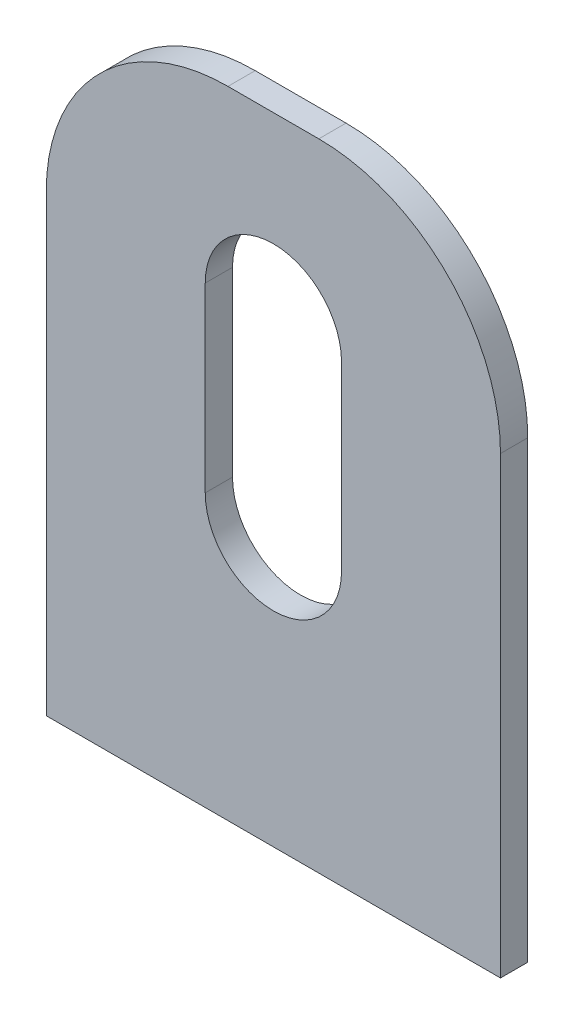
ISO-10303-21;
HEADER;
FILE_DESCRIPTION(('STEP AP214'),'2;1');
FILE_NAME('part.step','',(''),(''),'','','');
FILE_SCHEMA(('AUTOMOTIVE_DESIGN { 1 0 10303 214 1 1 1 1 }'));
ENDSEC;
DATA;
#1=APPLICATION_CONTEXT('core data for automotive mechanical design processes');
#2=APPLICATION_PROTOCOL_DEFINITION('international standard','automotive_design',2000,#1);
#3=PRODUCT_CONTEXT('',#1,'mechanical');
#4=PRODUCT('Part','Part','',(#3));
#5=PRODUCT_RELATED_PRODUCT_CATEGORY('part','',(#4));
#6=PRODUCT_DEFINITION_FORMATION('','',#4);
#7=PRODUCT_DEFINITION_CONTEXT('part definition',#1,'design');
#8=PRODUCT_DEFINITION('design','',#6,#7);
#9=PRODUCT_DEFINITION_SHAPE('','',#8);
#10=(LENGTH_UNIT() NAMED_UNIT(*) SI_UNIT(.MILLI.,.METRE.));
#11=(NAMED_UNIT(*) PLANE_ANGLE_UNIT() SI_UNIT($,.RADIAN.));
#12=(NAMED_UNIT(*) SI_UNIT($,.STERADIAN.) SOLID_ANGLE_UNIT());
#13=UNCERTAINTY_MEASURE_WITH_UNIT(LENGTH_MEASURE(1.E-05),#10,'distance_accuracy_value','');
#14=(GEOMETRIC_REPRESENTATION_CONTEXT(3) GLOBAL_UNCERTAINTY_ASSIGNED_CONTEXT((#13)) GLOBAL_UNIT_ASSIGNED_CONTEXT((#10,
#11,#12)) REPRESENTATION_CONTEXT('',''));
#15=CARTESIAN_POINT('',(0.,0.,0.));
#16=DIRECTION('',(0.,0.,1.));
#17=DIRECTION('',(1.,0.,0.));
#18=AXIS2_PLACEMENT_3D('',#15,#16,#17);
#19=CARTESIAN_POINT('',(-25.,40.,3.));
#20=DIRECTION('',(1.,0.,0.));
#21=DIRECTION('',(0.,1.,0.));
#22=AXIS2_PLACEMENT_3D('',#19,#20,#21);
#23=PLANE('',#22);
#24=DIRECTION('',(0.,-1.,0.));
#25=VECTOR('',#24,1.);
#26=CARTESIAN_POINT('',(-25.,40.,3.));
#27=LINE('',#26,#25);
#28=CARTESIAN_POINT('',(-25.,20.,3.));
#29=VERTEX_POINT('',#28);
#30=CARTESIAN_POINT('',(-25.,-30.,3.));
#31=VERTEX_POINT('',#30);
#32=EDGE_CURVE('E152',#29,#31,#27,.T.);
#33=ORIENTED_EDGE('',*,*,#32,.F.);
#34=DIRECTION('',(0.,0.,-1.));
#35=VECTOR('',#34,1.);
#36=CARTESIAN_POINT('',(-25.,20.,3.));
#37=LINE('',#36,#35);
#38=CARTESIAN_POINT('',(-25.,20.,0.));
#39=VERTEX_POINT('',#38);
#40=EDGE_CURVE('E11',#29,#39,#37,.T.);
#41=ORIENTED_EDGE('',*,*,#40,.T.);
#42=DIRECTION('',(0.,-1.,0.));
#43=VECTOR('',#42,1.);
#44=CARTESIAN_POINT('',(-25.,40.,0.));
#45=LINE('',#44,#43);
#46=CARTESIAN_POINT('',(-25.,-30.,0.));
#47=VERTEX_POINT('',#46);
#48=EDGE_CURVE('E162',#39,#47,#45,.T.);
#49=ORIENTED_EDGE('',*,*,#48,.T.);
#50=DIRECTION('',(0.,0.,-1.));
#51=VECTOR('',#50,1.);
#52=CARTESIAN_POINT('',(-25.,-30.,3.));
#53=LINE('',#52,#51);
#54=EDGE_CURVE('E172',#31,#47,#53,.T.);
#55=ORIENTED_EDGE('',*,*,#54,.F.);
#56=EDGE_LOOP('',(#33,#41,#49,#55));
#57=FACE_BOUND('',#56,.T.);
#58=ADVANCED_FACE('F35',(#57),#23,.F.);
#59=CARTESIAN_POINT('',(-25.,-30.,3.));
#60=DIRECTION('',(0.,1.,0.));
#61=DIRECTION('',(0.,0.,1.));
#62=AXIS2_PLACEMENT_3D('',#59,#60,#61);
#63=PLANE('',#62);
#64=DIRECTION('',(1.,0.,0.));
#65=VECTOR('',#64,1.);
#66=CARTESIAN_POINT('',(-25.,-30.,0.));
#67=LINE('',#66,#65);
#68=CARTESIAN_POINT('',(25.,-30.,0.));
#69=VERTEX_POINT('',#68);
#70=EDGE_CURVE('E164',#47,#69,#67,.T.);
#71=ORIENTED_EDGE('',*,*,#70,.T.);
#72=DIRECTION('',(0.,0.,-1.));
#73=VECTOR('',#72,1.);
#74=CARTESIAN_POINT('',(25.,-30.,3.));
#75=LINE('',#74,#73);
#76=CARTESIAN_POINT('',(25.,-30.,3.));
#77=VERTEX_POINT('',#76);
#78=EDGE_CURVE('E161',#77,#69,#75,.T.);
#79=ORIENTED_EDGE('',*,*,#78,.F.);
#80=DIRECTION('',(1.,0.,0.));
#81=VECTOR('',#80,1.);
#82=CARTESIAN_POINT('',(-25.,-30.,3.));
#83=LINE('',#82,#81);
#84=EDGE_CURVE('E154',#31,#77,#83,.T.);
#85=ORIENTED_EDGE('',*,*,#84,.F.);
#86=ORIENTED_EDGE('',*,*,#54,.T.);
#87=EDGE_LOOP('',(#71,#79,#85,#86));
#88=FACE_BOUND('',#87,.T.);
#89=ADVANCED_FACE('F207',(#88),#63,.F.);
#90=CARTESIAN_POINT('',(25.,40.,3.));
#91=DIRECTION('',(-1.,0.,0.));
#92=DIRECTION('',(0.,-1.,0.));
#93=AXIS2_PLACEMENT_3D('',#90,#91,#92);
#94=PLANE('',#93);
#95=DIRECTION('',(0.,1.,0.));
#96=VECTOR('',#95,1.);
#97=CARTESIAN_POINT('',(25.,40.,0.));
#98=LINE('',#97,#96);
#99=CARTESIAN_POINT('',(25.,20.,0.));
#100=VERTEX_POINT('',#99);
#101=EDGE_CURVE('E166',#69,#100,#98,.T.);
#102=ORIENTED_EDGE('',*,*,#101,.T.);
#103=DIRECTION('',(0.,0.,-1.));
#104=VECTOR('',#103,1.);
#105=CARTESIAN_POINT('',(25.,20.,3.));
#106=LINE('',#105,#104);
#107=CARTESIAN_POINT('',(25.,20.,3.));
#108=VERTEX_POINT('',#107);
#109=EDGE_CURVE('E58',#100,#108,#106,.F.);
#110=ORIENTED_EDGE('',*,*,#109,.T.);
#111=DIRECTION('',(0.,1.,0.));
#112=VECTOR('',#111,1.);
#113=CARTESIAN_POINT('',(25.,40.,3.));
#114=LINE('',#113,#112);
#115=EDGE_CURVE('E157',#77,#108,#114,.T.);
#116=ORIENTED_EDGE('',*,*,#115,.F.);
#117=ORIENTED_EDGE('',*,*,#78,.T.);
#118=EDGE_LOOP('',(#102,#110,#116,#117));
#119=FACE_BOUND('',#118,.T.);
#120=ADVANCED_FACE('F203',(#119),#94,.F.);
#121=CARTESIAN_POINT('',(-25.,40.,3.));
#122=DIRECTION('',(0.,-1.,0.));
#123=DIRECTION('',(0.,0.,-1.));
#124=AXIS2_PLACEMENT_3D('',#121,#122,#123);
#125=PLANE('',#124);
#126=DIRECTION('',(-1.,0.,0.));
#127=VECTOR('',#126,1.);
#128=CARTESIAN_POINT('',(-25.,40.,3.));
#129=LINE('',#128,#127);
#130=CARTESIAN_POINT('',(5.,40.,3.));
#131=VERTEX_POINT('',#130);
#132=CARTESIAN_POINT('',(-5.,40.,3.));
#133=VERTEX_POINT('',#132);
#134=EDGE_CURVE('E159',#131,#133,#129,.T.);
#135=ORIENTED_EDGE('',*,*,#134,.F.);
#136=DIRECTION('',(0.,0.,-1.));
#137=VECTOR('',#136,1.);
#138=CARTESIAN_POINT('',(5.,40.,3.));
#139=LINE('',#138,#137);
#140=CARTESIAN_POINT('',(5.,40.,0.));
#141=VERTEX_POINT('',#140);
#142=EDGE_CURVE('E183',#131,#141,#139,.T.);
#143=ORIENTED_EDGE('',*,*,#142,.T.);
#144=DIRECTION('',(-1.,0.,0.));
#145=VECTOR('',#144,1.);
#146=CARTESIAN_POINT('',(-25.,40.,0.));
#147=LINE('',#146,#145);
#148=CARTESIAN_POINT('',(-5.,40.,0.));
#149=VERTEX_POINT('',#148);
#150=EDGE_CURVE('E155',#141,#149,#147,.T.);
#151=ORIENTED_EDGE('',*,*,#150,.T.);
#152=DIRECTION('',(0.,0.,-1.));
#153=VECTOR('',#152,1.);
#154=CARTESIAN_POINT('',(-5.,40.,3.));
#155=LINE('',#154,#153);
#156=EDGE_CURVE('E175',#149,#133,#155,.F.);
#157=ORIENTED_EDGE('',*,*,#156,.T.);
#158=EDGE_LOOP('',(#135,#143,#151,#157));
#159=FACE_BOUND('',#158,.T.);
#160=ADVANCED_FACE('F197',(#159),#125,.F.);
#161=CARTESIAN_POINT('',(0.,0.,3.));
#162=DIRECTION('',(0.,0.,1.));
#163=DIRECTION('',(1.,0.,0.));
#164=AXIS2_PLACEMENT_3D('',#161,#162,#163);
#165=PLANE('',#164);
#166=CARTESIAN_POINT('',(0.,0.,3.));
#167=DIRECTION('',(0.,0.,1.));
#168=DIRECTION('',(1.,0.,0.));
#169=AXIS2_PLACEMENT_3D('',#166,#167,#168);
#170=CIRCLE('',#169,7.5);
#171=CARTESIAN_POINT('',(-7.5,0.,3.));
#172=VERTEX_POINT('',#171);
#173=CARTESIAN_POINT('',(7.5,0.,3.));
#174=VERTEX_POINT('',#173);
#175=EDGE_CURVE('E123',#172,#174,#170,.T.);
#176=ORIENTED_EDGE('',*,*,#175,.F.);
#177=DIRECTION('',(0.,1.,0.));
#178=VECTOR('',#177,1.);
#179=CARTESIAN_POINT('',(-7.5,0.,3.));
#180=LINE('',#179,#178);
#181=CARTESIAN_POINT('',(-7.5,20.,3.));
#182=VERTEX_POINT('',#181);
#183=EDGE_CURVE('E179',#182,#172,#180,.F.);
#184=ORIENTED_EDGE('',*,*,#183,.F.);
#185=CARTESIAN_POINT('',(0.,20.,3.));
#186=DIRECTION('',(0.,0.,1.));
#187=DIRECTION('',(1.,0.,0.));
#188=AXIS2_PLACEMENT_3D('',#185,#186,#187);
#189=CIRCLE('',#188,7.5);
#190=CARTESIAN_POINT('',(7.5,20.,3.));
#191=VERTEX_POINT('',#190);
#192=EDGE_CURVE('E177',#191,#182,#189,.T.);
#193=ORIENTED_EDGE('',*,*,#192,.F.);
#194=DIRECTION('',(0.,1.,0.));
#195=VECTOR('',#194,1.);
#196=CARTESIAN_POINT('',(7.5,0.,3.));
#197=LINE('',#196,#195);
#198=EDGE_CURVE('E149',#174,#191,#197,.T.);
#199=ORIENTED_EDGE('',*,*,#198,.F.);
#200=EDGE_LOOP('',(#176,#184,#193,#199));
#201=FACE_BOUND('',#200,.T.);
#202=ORIENTED_EDGE('',*,*,#115,.T.);
#203=CARTESIAN_POINT('',(5.,20.,3.));
#204=DIRECTION('',(0.,0.,1.));
#205=DIRECTION('',(1.,0.,0.));
#206=AXIS2_PLACEMENT_3D('',#203,#204,#205);
#207=CIRCLE('',#206,20.);
#208=EDGE_CURVE('E43',#108,#131,#207,.T.);
#209=ORIENTED_EDGE('',*,*,#208,.T.);
#210=ORIENTED_EDGE('',*,*,#134,.T.);
#211=CARTESIAN_POINT('',(-5.00000000000001,20.,3.));
#212=DIRECTION('',(0.,0.,1.));
#213=DIRECTION('',(1.,0.,0.));
#214=AXIS2_PLACEMENT_3D('',#211,#212,#213);
#215=CIRCLE('',#214,20.);
#216=EDGE_CURVE('E50',#133,#29,#215,.T.);
#217=ORIENTED_EDGE('',*,*,#216,.T.);
#218=ORIENTED_EDGE('',*,*,#32,.T.);
#219=ORIENTED_EDGE('',*,*,#84,.T.);
#220=EDGE_LOOP('',(#202,#209,#210,#217,#218,#219));
#221=FACE_BOUND('',#220,.T.);
#222=ADVANCED_FACE('F193',(#201,#221),#165,.T.);
#223=CARTESIAN_POINT('',(0.,0.,0.));
#224=DIRECTION('',(0.,0.,1.));
#225=DIRECTION('',(1.,0.,0.));
#226=AXIS2_PLACEMENT_3D('',#223,#224,#225);
#227=PLANE('',#226);
#228=DIRECTION('',(0.,-1.,0.));
#229=VECTOR('',#228,1.);
#230=CARTESIAN_POINT('',(-7.5,0.,0.));
#231=LINE('',#230,#229);
#232=CARTESIAN_POINT('',(-7.5,20.,0.));
#233=VERTEX_POINT('',#232);
#234=CARTESIAN_POINT('',(-7.5,0.,0.));
#235=VERTEX_POINT('',#234);
#236=EDGE_CURVE('E127',#233,#235,#231,.T.);
#237=ORIENTED_EDGE('',*,*,#236,.T.);
#238=CARTESIAN_POINT('',(0.,0.,0.));
#239=DIRECTION('',(0.,0.,1.));
#240=DIRECTION('',(1.,0.,0.));
#241=AXIS2_PLACEMENT_3D('',#238,#239,#240);
#242=CIRCLE('',#241,7.5);
#243=CARTESIAN_POINT('',(7.5,0.,0.));
#244=VERTEX_POINT('',#243);
#245=EDGE_CURVE('E120',#235,#244,#242,.T.);
#246=ORIENTED_EDGE('',*,*,#245,.T.);
#247=DIRECTION('',(0.,1.,0.));
#248=VECTOR('',#247,1.);
#249=CARTESIAN_POINT('',(7.5,0.,0.));
#250=LINE('',#249,#248);
#251=CARTESIAN_POINT('',(7.5,20.,0.));
#252=VERTEX_POINT('',#251);
#253=EDGE_CURVE('E131',#244,#252,#250,.T.);
#254=ORIENTED_EDGE('',*,*,#253,.T.);
#255=CARTESIAN_POINT('',(0.,20.,0.));
#256=DIRECTION('',(0.,0.,1.));
#257=DIRECTION('',(1.,0.,0.));
#258=AXIS2_PLACEMENT_3D('',#255,#256,#257);
#259=CIRCLE('',#258,7.5);
#260=EDGE_CURVE('E136',#252,#233,#259,.T.);
#261=ORIENTED_EDGE('',*,*,#260,.T.);
#262=EDGE_LOOP('',(#237,#246,#254,#261));
#263=FACE_BOUND('',#262,.T.);
#264=ORIENTED_EDGE('',*,*,#150,.F.);
#265=CARTESIAN_POINT('',(5.,20.,0.));
#266=DIRECTION('',(0.,0.,1.));
#267=DIRECTION('',(1.,0.,0.));
#268=AXIS2_PLACEMENT_3D('',#265,#266,#267);
#269=CIRCLE('',#268,20.);
#270=EDGE_CURVE('E188',#141,#100,#269,.F.);
#271=ORIENTED_EDGE('',*,*,#270,.T.);
#272=ORIENTED_EDGE('',*,*,#101,.F.);
#273=ORIENTED_EDGE('',*,*,#70,.F.);
#274=ORIENTED_EDGE('',*,*,#48,.F.);
#275=CARTESIAN_POINT('',(-5.00000000000001,20.,0.));
#276=DIRECTION('',(0.,0.,1.));
#277=DIRECTION('',(1.,0.,0.));
#278=AXIS2_PLACEMENT_3D('',#275,#276,#277);
#279=CIRCLE('',#278,20.);
#280=EDGE_CURVE('E186',#39,#149,#279,.F.);
#281=ORIENTED_EDGE('',*,*,#280,.T.);
#282=EDGE_LOOP('',(#264,#271,#272,#273,#274,#281));
#283=FACE_BOUND('',#282,.T.);
#284=ADVANCED_FACE('F138',(#263,#283),#227,.F.);
#285=CARTESIAN_POINT('',(0.,0.,0.));
#286=DIRECTION('',(0.,0.,1.));
#287=DIRECTION('',(1.,0.,0.));
#288=AXIS2_PLACEMENT_3D('',#285,#286,#287);
#289=CYLINDRICAL_SURFACE('',#288,7.5);
#290=ORIENTED_EDGE('',*,*,#175,.T.);
#291=DIRECTION('',(0.,0.,1.));
#292=VECTOR('',#291,1.);
#293=CARTESIAN_POINT('',(7.5,0.,0.));
#294=LINE('',#293,#292);
#295=EDGE_CURVE('E115',#244,#174,#294,.T.);
#296=ORIENTED_EDGE('',*,*,#295,.F.);
#297=ORIENTED_EDGE('',*,*,#245,.F.);
#298=DIRECTION('',(0.,0.,1.));
#299=VECTOR('',#298,1.);
#300=CARTESIAN_POINT('',(-7.5,0.,0.));
#301=LINE('',#300,#299);
#302=EDGE_CURVE('E148',#235,#172,#301,.T.);
#303=ORIENTED_EDGE('',*,*,#302,.T.);
#304=EDGE_LOOP('',(#290,#296,#297,#303));
#305=FACE_BOUND('',#304,.T.);
#306=ADVANCED_FACE('F117',(#305),#289,.F.);
#307=CARTESIAN_POINT('',(-7.5,0.,0.));
#308=DIRECTION('',(-1.,0.,0.));
#309=DIRECTION('',(0.,0.,1.));
#310=AXIS2_PLACEMENT_3D('',#307,#308,#309);
#311=PLANE('',#310);
#312=ORIENTED_EDGE('',*,*,#183,.T.);
#313=ORIENTED_EDGE('',*,*,#302,.F.);
#314=ORIENTED_EDGE('',*,*,#236,.F.);
#315=DIRECTION('',(0.,0.,1.));
#316=VECTOR('',#315,1.);
#317=CARTESIAN_POINT('',(-7.5,20.,0.));
#318=LINE('',#317,#316);
#319=EDGE_CURVE('E145',#233,#182,#318,.T.);
#320=ORIENTED_EDGE('',*,*,#319,.T.);
#321=EDGE_LOOP('',(#312,#313,#314,#320));
#322=FACE_BOUND('',#321,.T.);
#323=ADVANCED_FACE('F235',(#322),#311,.F.);
#324=CARTESIAN_POINT('',(0.,20.,0.));
#325=DIRECTION('',(0.,0.,1.));
#326=DIRECTION('',(1.,0.,0.));
#327=AXIS2_PLACEMENT_3D('',#324,#325,#326);
#328=CYLINDRICAL_SURFACE('',#327,7.5);
#329=ORIENTED_EDGE('',*,*,#192,.T.);
#330=ORIENTED_EDGE('',*,*,#319,.F.);
#331=ORIENTED_EDGE('',*,*,#260,.F.);
#332=DIRECTION('',(0.,0.,1.));
#333=VECTOR('',#332,1.);
#334=CARTESIAN_POINT('',(7.5,20.,0.));
#335=LINE('',#334,#333);
#336=EDGE_CURVE('E126',#252,#191,#335,.T.);
#337=ORIENTED_EDGE('',*,*,#336,.T.);
#338=EDGE_LOOP('',(#329,#330,#331,#337));
#339=FACE_BOUND('',#338,.T.);
#340=ADVANCED_FACE('F238',(#339),#328,.F.);
#341=CARTESIAN_POINT('',(7.5,0.,0.));
#342=DIRECTION('',(1.,0.,0.));
#343=DIRECTION('',(0.,0.,-1.));
#344=AXIS2_PLACEMENT_3D('',#341,#342,#343);
#345=PLANE('',#344);
#346=ORIENTED_EDGE('',*,*,#198,.T.);
#347=ORIENTED_EDGE('',*,*,#336,.F.);
#348=ORIENTED_EDGE('',*,*,#253,.F.);
#349=ORIENTED_EDGE('',*,*,#295,.T.);
#350=EDGE_LOOP('',(#346,#347,#348,#349));
#351=FACE_BOUND('',#350,.T.);
#352=ADVANCED_FACE('F132',(#351),#345,.F.);
#353=CARTESIAN_POINT('',(5.,20.,3.));
#354=DIRECTION('',(0.,0.,-1.));
#355=DIRECTION('',(-1.,0.,0.));
#356=AXIS2_PLACEMENT_3D('',#353,#354,#355);
#357=CYLINDRICAL_SURFACE('',#356,20.);
#358=ORIENTED_EDGE('',*,*,#208,.F.);
#359=ORIENTED_EDGE('',*,*,#109,.F.);
#360=ORIENTED_EDGE('',*,*,#270,.F.);
#361=ORIENTED_EDGE('',*,*,#142,.F.);
#362=EDGE_LOOP('',(#358,#359,#360,#361));
#363=FACE_BOUND('',#362,.T.);
#364=ADVANCED_FACE('F200',(#363),#357,.T.);
#365=CARTESIAN_POINT('',(-5.00000000000001,20.,3.));
#366=DIRECTION('',(0.,0.,-1.));
#367=DIRECTION('',(-1.,0.,0.));
#368=AXIS2_PLACEMENT_3D('',#365,#366,#367);
#369=CYLINDRICAL_SURFACE('',#368,20.);
#370=ORIENTED_EDGE('',*,*,#216,.F.);
#371=ORIENTED_EDGE('',*,*,#156,.F.);
#372=ORIENTED_EDGE('',*,*,#280,.F.);
#373=ORIENTED_EDGE('',*,*,#40,.F.);
#374=EDGE_LOOP('',(#370,#371,#372,#373));
#375=FACE_BOUND('',#374,.T.);
#376=ADVANCED_FACE('F37',(#375),#369,.T.);
#377=CLOSED_SHELL('',(#58,#89,#120,#160,#222,#284,#306,#323,#340,#352,#364,#376));
#378=MANIFOLD_SOLID_BREP('B2',#377);
#379=ADVANCED_BREP_SHAPE_REPRESENTATION('',(#18,#378),#14);
#380=SHAPE_DEFINITION_REPRESENTATION(#9,#379);
ENDSEC;
END-ISO-10303-21;
